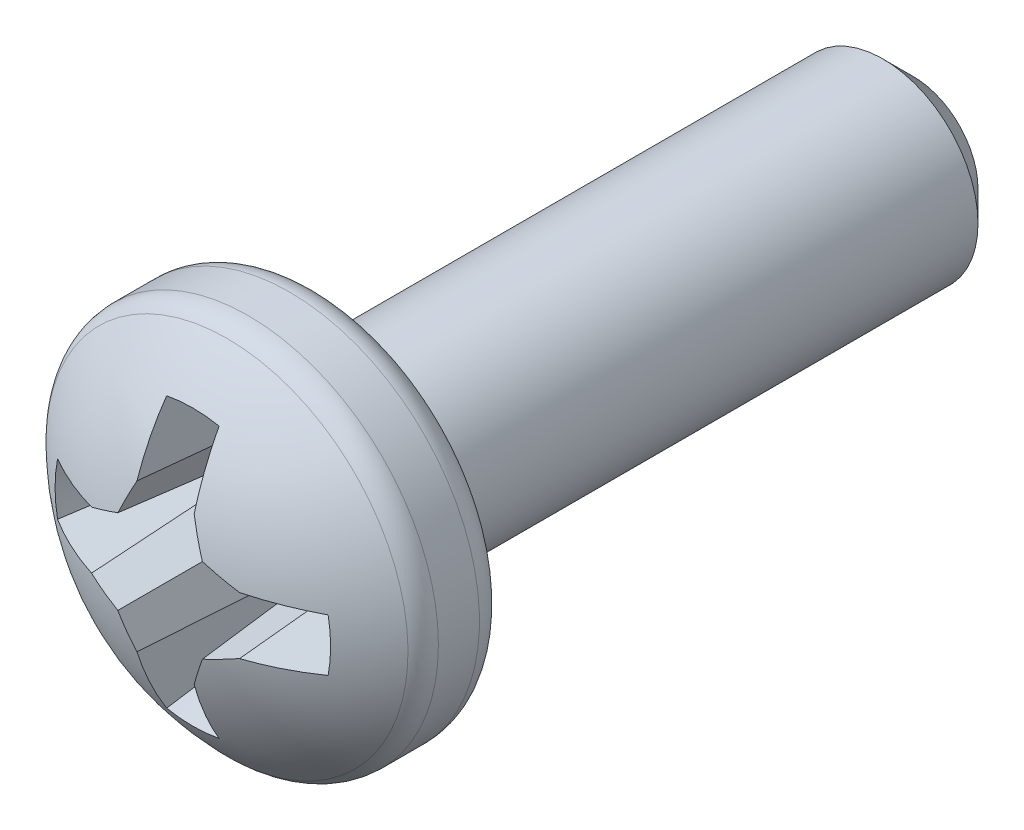
ISO-10303-21;
HEADER;
FILE_DESCRIPTION(('STEP AP214'),'2;1');
FILE_NAME('part.step','',(''),(''),'','','');
FILE_SCHEMA(('AUTOMOTIVE_DESIGN { 1 0 10303 214 1 1 1 1 }'));
ENDSEC;
DATA;
#1=APPLICATION_CONTEXT('core data for automotive mechanical design processes');
#2=APPLICATION_PROTOCOL_DEFINITION('international standard','automotive_design',2000,#1);
#3=PRODUCT_CONTEXT('',#1,'mechanical');
#4=PRODUCT('Part','Part','',(#3));
#5=PRODUCT_RELATED_PRODUCT_CATEGORY('part','',(#4));
#6=PRODUCT_DEFINITION_FORMATION('','',#4);
#7=PRODUCT_DEFINITION_CONTEXT('part definition',#1,'design');
#8=PRODUCT_DEFINITION('design','',#6,#7);
#9=PRODUCT_DEFINITION_SHAPE('','',#8);
#10=(LENGTH_UNIT() NAMED_UNIT(*) SI_UNIT(.MILLI.,.METRE.));
#11=(NAMED_UNIT(*) PLANE_ANGLE_UNIT() SI_UNIT($,.RADIAN.));
#12=(NAMED_UNIT(*) SI_UNIT($,.STERADIAN.) SOLID_ANGLE_UNIT());
#13=UNCERTAINTY_MEASURE_WITH_UNIT(LENGTH_MEASURE(1.E-05),#10,'distance_accuracy_value','');
#14=(GEOMETRIC_REPRESENTATION_CONTEXT(3) GLOBAL_UNCERTAINTY_ASSIGNED_CONTEXT((#13)) GLOBAL_UNIT_ASSIGNED_CONTEXT((#10,
#11,#12)) REPRESENTATION_CONTEXT('',''));
#15=CARTESIAN_POINT('',(0.,0.,0.));
#16=DIRECTION('',(0.,0.,1.));
#17=DIRECTION('',(1.,0.,0.));
#18=AXIS2_PLACEMENT_3D('',#15,#16,#17);
#19=CARTESIAN_POINT('',(1.1012783253842,0.791461441644268,0.413196607862429));
#20=DIRECTION('',(0.,0.,1.));
#21=DIRECTION('',(1.,0.,0.));
#22=AXIS2_PLACEMENT_3D('',#19,#20,#21);
#23=PLANE('',#22);
#24=DIRECTION('',(0.382683432365081,-0.92387953251129,0.));
#25=VECTOR('',#24,1.);
#26=CARTESIAN_POINT('',(1.11459221215408,0.796976234112247,0.413196607862429));
#27=LINE('',#26,#25);
#28=CARTESIAN_POINT('',(1.1070219667387,0.815252423264536,0.413196607862429));
#29=VERTEX_POINT('',#28);
#30=CARTESIAN_POINT('',(1.11230791032016,0.802491026580227,0.413196607862429));
#31=VERTEX_POINT('',#30);
#32=EDGE_CURVE('E292',#29,#31,#27,.T.);
#33=ORIENTED_EDGE('',*,*,#32,.F.);
#34=DIRECTION('',(0.,1.,0.));
#35=VECTOR('',#34,1.);
#36=CARTESIAN_POINT('',(1.10702196673869,0.791461441644268,0.413196607862429));
#37=LINE('',#36,#35);
#38=CARTESIAN_POINT('',(1.10702196673869,0.82766777029474,0.413196607862429));
#39=VERTEX_POINT('',#38);
#40=EDGE_CURVE('E168',#39,#29,#37,.F.);
#41=ORIENTED_EDGE('',*,*,#40,.F.);
#42=CARTESIAN_POINT('',(1.1012783253842,0.791461441644268,0.413196607862429));
#43=DIRECTION('',(0.,0.,1.));
#44=DIRECTION('',(1.,0.,0.));
#45=AXIS2_PLACEMENT_3D('',#42,#43,#44);
#46=CIRCLE('',#45,0.0366590732337168);
#47=CARTESIAN_POINT('',(1.09553468402971,0.827667770294741,0.413196607862429));
#48=VERTEX_POINT('',#47);
#49=EDGE_CURVE('E159',#39,#48,#46,.T.);
#50=ORIENTED_EDGE('',*,*,#49,.T.);
#51=DIRECTION('',(0.,1.,0.));
#52=VECTOR('',#51,1.);
#53=CARTESIAN_POINT('',(1.09553468402971,0.791461441644271,0.413196607862429));
#54=LINE('',#53,#52);
#55=CARTESIAN_POINT('',(1.09553468402971,0.815252423264539,0.413196607862429));
#56=VERTEX_POINT('',#55);
#57=EDGE_CURVE('E166',#56,#48,#54,.T.);
#58=ORIENTED_EDGE('',*,*,#57,.F.);
#59=DIRECTION('',(0.382683432365079,0.923879532511291,0.));
#60=VECTOR('',#59,1.);
#61=CARTESIAN_POINT('',(1.08796443861433,0.79697623411225,0.413196607862429));
#62=LINE('',#61,#60);
#63=CARTESIAN_POINT('',(1.09024874044825,0.80249102658023,0.413196607862429));
#64=VERTEX_POINT('',#63);
#65=EDGE_CURVE('E301',#64,#56,#62,.T.);
#66=ORIENTED_EDGE('',*,*,#65,.F.);
#67=DIRECTION('',(0.923879532511289,0.382683432365086,0.));
#68=VECTOR('',#67,1.);
#69=CARTESIAN_POINT('',(1.09576353291623,0.804775328414139,0.413196607862429));
#70=LINE('',#69,#68);
#71=CARTESIAN_POINT('',(1.07748734376394,0.797205082998765,0.413196607862429));
#72=VERTEX_POINT('',#71);
#73=EDGE_CURVE('E307',#72,#64,#70,.T.);
#74=ORIENTED_EDGE('',*,*,#73,.F.);
#75=DIRECTION('',(1.,0.,0.));
#76=VECTOR('',#75,1.);
#77=CARTESIAN_POINT('',(1.10127832538421,0.797205082998765,0.413196607862429));
#78=LINE('',#77,#76);
#79=CARTESIAN_POINT('',(1.06507199667653,0.797205082997996,0.413196607853643));
#80=VERTEX_POINT('',#79);
#81=EDGE_CURVE('E313',#80,#72,#78,.T.);
#82=ORIENTED_EDGE('',*,*,#81,.F.);
#83=CARTESIAN_POINT('',(1.10127832538421,0.791461441644271,0.413196607862429));
#84=DIRECTION('',(0.,0.,1.));
#85=DIRECTION('',(1.,0.,0.));
#86=AXIS2_PLACEMENT_3D('',#83,#84,#85);
#87=CIRCLE('',#86,0.0366590732924525);
#88=CARTESIAN_POINT('',(1.06507199667427,0.78571780028978,0.413196607862429));
#89=VERTEX_POINT('',#88);
#90=EDGE_CURVE('E410',#80,#89,#87,.T.);
#91=ORIENTED_EDGE('',*,*,#90,.T.);
#92=DIRECTION('',(1.,0.,0.));
#93=VECTOR('',#92,1.);
#94=CARTESIAN_POINT('',(1.1012783253842,0.78571780028978,0.413196607862429));
#95=LINE('',#94,#93);
#96=CARTESIAN_POINT('',(1.07748734376393,0.78571780028978,0.413196607862429));
#97=VERTEX_POINT('',#96);
#98=EDGE_CURVE('E247',#97,#89,#95,.F.);
#99=ORIENTED_EDGE('',*,*,#98,.F.);
#100=DIRECTION('',(-0.923879532511292,0.382683432365076,0.));
#101=VECTOR('',#100,1.);
#102=CARTESIAN_POINT('',(1.09576353291622,0.778147554874406,0.413196607862429));
#103=LINE('',#102,#101);
#104=CARTESIAN_POINT('',(1.09024874044825,0.780431856708313,0.413196607862429));
#105=VERTEX_POINT('',#104);
#106=EDGE_CURVE('E248',#105,#97,#103,.T.);
#107=ORIENTED_EDGE('',*,*,#106,.F.);
#108=DIRECTION('',(-0.38268343236509,0.923879532511287,0.));
#109=VECTOR('',#108,1.);
#110=CARTESIAN_POINT('',(1.08796443861433,0.785946649176296,0.413196607862429));
#111=LINE('',#110,#109);
#112=CARTESIAN_POINT('',(1.09553468402971,0.767670460024005,0.413196607862429));
#113=VERTEX_POINT('',#112);
#114=EDGE_CURVE('E254',#113,#105,#111,.T.);
#115=ORIENTED_EDGE('',*,*,#114,.F.);
#116=DIRECTION('',(0.,1.,0.));
#117=VECTOR('',#116,1.);
#118=CARTESIAN_POINT('',(1.09553468402971,0.791461441644275,0.413196607862429));
#119=LINE('',#118,#117);
#120=CARTESIAN_POINT('',(1.09553468402971,0.755255112951671,0.413196607862429));
#121=VERTEX_POINT('',#120);
#122=EDGE_CURVE('E260',#121,#113,#119,.T.);
#123=ORIENTED_EDGE('',*,*,#122,.F.);
#124=CARTESIAN_POINT('',(1.1012783253842,0.791461441644275,0.413196607862429));
#125=DIRECTION('',(0.,0.,1.));
#126=DIRECTION('',(1.,0.,0.));
#127=AXIS2_PLACEMENT_3D('',#124,#125,#126);
#128=CIRCLE('',#127,0.0366590732753286);
#129=CARTESIAN_POINT('',(1.1070219667387,0.755255112951671,0.413196607862429));
#130=VERTEX_POINT('',#129);
#131=EDGE_CURVE('E336',#121,#130,#128,.T.);
#132=ORIENTED_EDGE('',*,*,#131,.T.);
#133=DIRECTION('',(0.,1.,0.));
#134=VECTOR('',#133,1.);
#135=CARTESIAN_POINT('',(1.1070219667387,0.791461441644272,0.413196607862429));
#136=LINE('',#135,#134);
#137=CARTESIAN_POINT('',(1.10702196673869,0.767670460024002,0.413196607862429));
#138=VERTEX_POINT('',#137);
#139=EDGE_CURVE('E266',#138,#130,#136,.F.);
#140=ORIENTED_EDGE('',*,*,#139,.F.);
#141=DIRECTION('',(-0.382683432365075,-0.923879532511293,0.));
#142=VECTOR('',#141,1.);
#143=CARTESIAN_POINT('',(1.11459221215407,0.785946649176293,0.413196607862429));
#144=LINE('',#143,#142);
#145=CARTESIAN_POINT('',(1.11230791032016,0.780431856708314,0.413196607862429));
#146=VERTEX_POINT('',#145);
#147=EDGE_CURVE('E267',#146,#138,#144,.T.);
#148=ORIENTED_EDGE('',*,*,#147,.F.);
#149=DIRECTION('',(-0.923879532511286,-0.382683432365092,0.));
#150=VECTOR('',#149,1.);
#151=CARTESIAN_POINT('',(1.10679311785218,0.778147554874402,0.413196607862429));
#152=LINE('',#151,#150);
#153=CARTESIAN_POINT('',(1.12506930700447,0.785717800289777,0.413196607862429));
#154=VERTEX_POINT('',#153);
#155=EDGE_CURVE('E273',#154,#146,#152,.T.);
#156=ORIENTED_EDGE('',*,*,#155,.F.);
#157=DIRECTION('',(1.,0.,0.));
#158=VECTOR('',#157,1.);
#159=CARTESIAN_POINT('',(1.1012783253842,0.785717800289777,0.413196607862429));
#160=LINE('',#159,#158);
#161=CARTESIAN_POINT('',(1.13748465403467,0.785717800289777,0.413196607862429));
#162=VERTEX_POINT('',#161);
#163=EDGE_CURVE('E279',#162,#154,#160,.F.);
#164=ORIENTED_EDGE('',*,*,#163,.F.);
#165=CARTESIAN_POINT('',(1.1012783253842,0.791461441644268,0.413196607862429));
#166=DIRECTION('',(0.,0.,1.));
#167=DIRECTION('',(1.,0.,0.));
#168=AXIS2_PLACEMENT_3D('',#165,#166,#167);
#169=CIRCLE('',#168,0.0366590732337168);
#170=CARTESIAN_POINT('',(1.13748465403467,0.797205082998762,0.413196607862429));
#171=VERTEX_POINT('',#170);
#172=EDGE_CURVE('E492',#162,#171,#169,.T.);
#173=ORIENTED_EDGE('',*,*,#172,.T.);
#174=DIRECTION('',(1.,0.,0.));
#175=VECTOR('',#174,1.);
#176=CARTESIAN_POINT('',(1.1012783253842,0.797205082998762,0.413196607862429));
#177=LINE('',#176,#175);
#178=CARTESIAN_POINT('',(1.12506930700447,0.797205082998762,0.413196607862429));
#179=VERTEX_POINT('',#178);
#180=EDGE_CURVE('E285',#179,#171,#177,.T.);
#181=ORIENTED_EDGE('',*,*,#180,.F.);
#182=DIRECTION('',(0.92387953251129,-0.382683432365083,0.));
#183=VECTOR('',#182,1.);
#184=CARTESIAN_POINT('',(1.10679311785218,0.804775328414136,0.413196607862429));
#185=LINE('',#184,#183);
#186=EDGE_CURVE('E286',#31,#179,#185,.T.);
#187=ORIENTED_EDGE('',*,*,#186,.F.);
#188=EDGE_LOOP('',(#33,#41,#50,#58,#66,#74,#82,#91,#99,#107,#115,#123,#132,#140,#148,#156,#164,
#173,#181,#187));
#189=FACE_BOUND('',#188,.T.);
#190=ADVANCED_FACE('F17',(#189),#23,.T.);
#191=CARTESIAN_POINT('',(1.10127832538421,0.801303961329311,0.460047001563216));
#192=DIRECTION('',(0.,-0.996194698091744,0.0871557427476727));
#193=DIRECTION('',(0.,-0.0871557427476727,-0.996194698091744));
#194=AXIS2_PLACEMENT_3D('',#191,#192,#193);
#195=PLANE('',#194);
#196=DIRECTION('',(0.0173337504938674,-0.0871426484044457,-0.996045029063885));
#197=VECTOR('',#196,1.);
#198=CARTESIAN_POINT('',(1.07674394325958,0.8009424097128,0.455914447676356));
#199=LINE('',#198,#197);
#200=CARTESIAN_POINT('',(1.07674394325958,0.8009424097128,0.455914447676357));
#201=VERTEX_POINT('',#200);
#202=EDGE_CURVE('E310',#201,#72,#199,.T.);
#203=ORIENTED_EDGE('',*,*,#202,.F.);
#204=CARTESIAN_POINT('',(1.0564306923124,0.800151088875881,0.4468696091221));
#205=CARTESIAN_POINT('',(1.05961905199557,0.800321424804083,0.448816557690385));
#206=CARTESIAN_POINT('',(1.06290600274941,0.800472536171256,0.450543768520715));
#207=CARTESIAN_POINT('',(1.06967708639845,0.800736309783544,0.453558714705463));
#208=CARTESIAN_POINT('',(1.07316121929364,0.800848972028658,0.454846450059882));
#209=CARTESIAN_POINT('',(1.07674394325952,0.800942409712743,0.455914447676345));
#210=B_SPLINE_CURVE_WITH_KNOTS('',3,(#204,#205,#206,#207,#208,#209),.UNSPECIFIED.,.F.,.F.,(4,2,
4),(0.,0.011148597867128,0.0222971957342561),.UNSPECIFIED.);
#211=CARTESIAN_POINT('',(1.05643069232298,0.800151088874494,0.446869609106246));
#212=VERTEX_POINT('',#211);
#213=EDGE_CURVE('E409',#212,#201,#210,.T.);
#214=ORIENTED_EDGE('',*,*,#213,.F.);
#215=CARTESIAN_POINT('',(1.05643069233356,0.800151088873107,0.446869609090393));
#216=CARTESIAN_POINT('',(1.05786716011132,0.79966000435443,0.441256487356839));
#217=CARTESIAN_POINT('',(1.05930550268687,0.799168961608414,0.435643843086987));
#218=CARTESIAN_POINT('',(1.06218593746853,0.798186959649786,0.424419509338453));
#219=CARTESIAN_POINT('',(1.06362802967472,0.797696000437175,0.418807819859795));
#220=CARTESIAN_POINT('',(1.06507199667879,0.797205082997228,0.413196607844861));
#221=B_SPLINE_CURVE_WITH_KNOTS('',3,(#215,#216,#217,#218,#219,#220),.UNSPECIFIED.,.F.,.F.,(4,2,
4),(0.,0.0174443558891333,0.0348887122017169),.UNSPECIFIED.);
#222=EDGE_CURVE('E318',#212,#80,#221,.T.);
#223=ORIENTED_EDGE('',*,*,#222,.T.);
#224=ORIENTED_EDGE('',*,*,#81,.T.);
#225=EDGE_LOOP('',(#203,#214,#223,#224));
#226=FACE_BOUND('',#225,.T.);
#227=ADVANCED_FACE('F427',(#226),#195,.T.);
#228=CARTESIAN_POINT('',(1.09419496008785,0.808562198209984,0.460047001563216));
#229=DIRECTION('',(0.381227206369649,-0.920363891963225,0.0871557427476661));
#230=DIRECTION('',(0.923879532511289,0.382683432365086,0.));
#231=AXIS2_PLACEMENT_3D('',#228,#229,#230);
#232=PLANE('',#231);
#233=DIRECTION('',(0.0666626913468176,-0.0666626913468491,-0.995546167269401));
#234=VECTOR('',#233,1.);
#235=CARTESIAN_POINT('',(1.08726696169668,0.805472805331793,0.457726739301585));
#236=LINE('',#235,#234);
#237=CARTESIAN_POINT('',(1.08726696169668,0.805472805331793,0.457726739301586));
#238=VERTEX_POINT('',#237);
#239=EDGE_CURVE('E304',#238,#64,#236,.T.);
#240=ORIENTED_EDGE('',*,*,#239,.F.);
#241=CARTESIAN_POINT('',(1.07674394325958,0.8009424097128,0.455914447676357));
#242=CARTESIAN_POINT('',(1.07847431281451,0.801700049456702,0.4563463218226));
#243=CARTESIAN_POINT('',(1.08021641579507,0.802456402296903,0.456713283197824));
#244=CARTESIAN_POINT('',(1.08372408860744,0.803966534169899,0.457317380406234));
#245=CARTESIAN_POINT('',(1.08548965843925,0.804720313202696,0.45755451623942));
#246=CARTESIAN_POINT('',(1.08726696169669,0.80547280533179,0.457726739301587));
#247=B_SPLINE_CURVE_WITH_KNOTS('',3,(#241,#242,#243,#244,#245,#246),.UNSPECIFIED.,.F.,.F.,(4,2,
4),(0.,0.0058030059091772,0.0116060118183545),.UNSPECIFIED.);
#248=EDGE_CURVE('E439',#201,#238,#247,.T.);
#249=ORIENTED_EDGE('',*,*,#248,.F.);
#250=ORIENTED_EDGE('',*,*,#202,.T.);
#251=ORIENTED_EDGE('',*,*,#73,.T.);
#252=EDGE_LOOP('',(#240,#249,#250,#251));
#253=FACE_BOUND('',#252,.T.);
#254=ADVANCED_FACE('F431',(#253),#232,.T.);
#255=CARTESIAN_POINT('',(1.08417756881849,0.79854480694063,0.460047001563216));
#256=DIRECTION('',(0.920363891963229,-0.381227206369643,0.0871557427476506));
#257=DIRECTION('',(0.382683432365079,0.923879532511291,0.));
#258=AXIS2_PLACEMENT_3D('',#255,#256,#257);
#259=PLANE('',#258);
#260=DIRECTION('',(0.0871426484044308,-0.0173337504938857,-0.996045029063886));
#261=VECTOR('',#260,1.);
#262=CARTESIAN_POINT('',(1.09179735731568,0.8159958237689,0.455914447676355));
#263=LINE('',#262,#261);
#264=CARTESIAN_POINT('',(1.09179735731568,0.8159958237689,0.455914447676355));
#265=VERTEX_POINT('',#264);
#266=EDGE_CURVE('E176',#265,#56,#263,.T.);
#267=ORIENTED_EDGE('',*,*,#266,.F.);
#268=CARTESIAN_POINT('',(1.08726696169668,0.805472805331793,0.457726739301586));
#269=CARTESIAN_POINT('',(1.08801945382578,0.807250108589228,0.457554516239418));
#270=CARTESIAN_POINT('',(1.08877323285857,0.809015678421038,0.457317380406232));
#271=CARTESIAN_POINT('',(1.09028336473157,0.812523351233407,0.456713283197822));
#272=CARTESIAN_POINT('',(1.09103971757177,0.814265454213967,0.456346321822597));
#273=CARTESIAN_POINT('',(1.09179735731568,0.815995823768902,0.455914447676354));
#274=B_SPLINE_CURVE_WITH_KNOTS('',3,(#268,#269,#270,#271,#272,#273),.UNSPECIFIED.,.F.,.F.,(4,2,
4),(0.,0.00580300590917744,0.0116060118183552),.UNSPECIFIED.);
#275=EDGE_CURVE('E445',#238,#265,#274,.T.);
#276=ORIENTED_EDGE('',*,*,#275,.F.);
#277=ORIENTED_EDGE('',*,*,#239,.T.);
#278=ORIENTED_EDGE('',*,*,#65,.T.);
#279=EDGE_LOOP('',(#267,#276,#277,#278));
#280=FACE_BOUND('',#279,.T.);
#281=ADVANCED_FACE('F436',(#280),#259,.T.);
#282=CARTESIAN_POINT('',(1.09143580569917,0.791461441644271,0.460047001563216));
#283=DIRECTION('',(0.996194698091747,0.,0.0871557427476441));
#284=DIRECTION('',(0.0871557427476441,0.,-0.996194698091747));
#285=AXIS2_PLACEMENT_3D('',#282,#283,#284);
#286=PLANE('',#285);
#287=CARTESIAN_POINT('',(1.09553468402404,0.827667770303427,0.413196607882759));
#288=CARTESIAN_POINT('',(1.09504376658613,0.829111737312785,0.418807819896611));
#289=CARTESIAN_POINT('',(1.09455280737493,0.830553829524812,0.424419509373993));
#290=CARTESIAN_POINT('',(1.09357080541786,0.833434264319245,0.435643843119583));
#291=CARTESIAN_POINT('',(1.09307976267199,0.834872606901741,0.441256487387769));
#292=CARTESIAN_POINT('',(1.09258867815283,0.836309074686999,0.446869609119461));
#293=B_SPLINE_CURVE_WITH_KNOTS('',3,(#287,#288,#289,#290,#291,#292),.UNSPECIFIED.,.F.,.F.,(4,2,
4),(0.,0.0174443563128722,0.0348887122022951),.UNSPECIFIED.);
#294=CARTESIAN_POINT('',(1.09258867815339,0.836309074685362,0.446869609113066));
#295=VERTEX_POINT('',#294);
#296=EDGE_CURVE('E170',#48,#295,#293,.T.);
#297=ORIENTED_EDGE('',*,*,#296,.T.);
#298=CARTESIAN_POINT('',(1.09179735731568,0.815995823768901,0.455914447676355));
#299=CARTESIAN_POINT('',(1.09189079499972,0.81957854773212,0.454846450060693));
#300=CARTESIAN_POINT('',(1.09200345724476,0.823062680624827,0.453558714707388));
#301=CARTESIAN_POINT('',(1.09226723085682,0.82983376426922,0.450543768525487));
#302=CARTESIAN_POINT('',(1.09241834222383,0.833120715020905,0.448816557696893));
#303=CARTESIAN_POINT('',(1.09258867815185,0.836309074702078,0.446869609130654));
#304=B_SPLINE_CURVE_WITH_KNOTS('',3,(#298,#299,#300,#301,#302,#303),.UNSPECIFIED.,.F.,.F.,(4,2,
4),(0.,0.011148597858965,0.0222971957179303),.UNSPECIFIED.);
#305=EDGE_CURVE('E450',#265,#295,#304,.T.);
#306=ORIENTED_EDGE('',*,*,#305,.F.);
#307=ORIENTED_EDGE('',*,*,#266,.T.);
#308=ORIENTED_EDGE('',*,*,#57,.T.);
#309=EDGE_LOOP('',(#297,#306,#307,#308));
#310=FACE_BOUND('',#309,.T.);
#311=ADVANCED_FACE('F173',(#310),#286,.T.);
#312=CARTESIAN_POINT('',(1.1012783253842,0.791461441644268,0.446869608992984));
#313=DIRECTION('',(0.,0.,1.));
#314=DIRECTION('',(1.,0.,0.));
#315=AXIS2_PLACEMENT_3D('',#312,#313,#314);
#316=CONICAL_SURFACE('',#315,0.0456817267126014,0.261799388331704);
#317=ORIENTED_EDGE('',*,*,#296,.F.);
#318=ORIENTED_EDGE('',*,*,#49,.F.);
#319=CARTESIAN_POINT('',(1.10996797262069,0.836309074692748,0.446869609127048));
#320=CARTESIAN_POINT('',(1.10947688809974,0.834872606905537,0.441256487392909));
#321=CARTESIAN_POINT('',(1.10898584535217,0.833434264321139,0.435643843122255));
#322=CARTESIAN_POINT('',(1.10800384339188,0.830553829523008,0.424419509371686));
#323=CARTESIAN_POINT('',(1.10751288417916,0.829111737309184,0.418807819891794));
#324=CARTESIAN_POINT('',(1.10702196673983,0.827667770298081,0.413196607875411));
#325=B_SPLINE_CURVE_WITH_KNOTS('',3,(#319,#320,#321,#322,#323,#324),.UNSPECIFIED.,.F.,.F.,(4,2,
4),(0.,0.017444355898411,0.0348887122202734),.UNSPECIFIED.);
#326=CARTESIAN_POINT('',(1.10996797261646,0.836309074695643,0.446869609129504));
#327=VERTEX_POINT('',#326);
#328=EDGE_CURVE('E182',#327,#39,#325,.T.);
#329=ORIENTED_EDGE('',*,*,#328,.F.);
#330=CARTESIAN_POINT('',(1.1012783253842,0.791461441644268,0.44686960910667));
#331=DIRECTION('',(0.,0.,1.));
#332=DIRECTION('',(1.,0.,0.));
#333=AXIS2_PLACEMENT_3D('',#330,#331,#332);
#334=CIRCLE('',#333,0.0456817267430637);
#335=EDGE_CURVE('E180',#295,#327,#334,.F.);
#336=ORIENTED_EDGE('',*,*,#335,.F.);
#337=EDGE_LOOP('',(#317,#318,#329,#336));
#338=FACE_BOUND('',#337,.T.);
#339=ADVANCED_FACE('F178',(#338),#316,.F.);
#340=CARTESIAN_POINT('',(1.11112084506924,0.791461441644268,0.460047001563216));
#341=DIRECTION('',(-0.996194698091746,0.,0.0871557427476584));
#342=DIRECTION('',(0.0871557427476584,0.,0.996194698091746));
#343=AXIS2_PLACEMENT_3D('',#340,#341,#342);
#344=PLANE('',#343);
#345=DIRECTION('',(-0.0871426484044237,-0.0173337504939004,-0.996045029063886));
#346=VECTOR('',#345,1.);
#347=CARTESIAN_POINT('',(1.11075929345274,0.815995823768898,0.455914447676356));
#348=LINE('',#347,#346);
#349=CARTESIAN_POINT('',(1.11075929345274,0.815995823768898,0.455914447676355));
#350=VERTEX_POINT('',#349);
#351=EDGE_CURVE('E295',#350,#29,#348,.T.);
#352=ORIENTED_EDGE('',*,*,#351,.F.);
#353=CARTESIAN_POINT('',(1.10996797261656,0.836309074702021,0.446869609130688));
#354=CARTESIAN_POINT('',(1.11013830854457,0.833120715020857,0.448816557696918));
#355=CARTESIAN_POINT('',(1.11028941991159,0.829833764269183,0.450543768525504));
#356=CARTESIAN_POINT('',(1.11055319352365,0.823062680624813,0.453558714707391));
#357=CARTESIAN_POINT('',(1.11066585576869,0.819578547732117,0.454846450060692));
#358=CARTESIAN_POINT('',(1.11075929345273,0.815995823768911,0.45591444767635));
#359=B_SPLINE_CURVE_WITH_KNOTS('',3,(#353,#354,#355,#356,#357,#358),.UNSPECIFIED.,.F.,.F.,(4,2,
4),(0.,0.0111485978589261,0.0222971957178522),.UNSPECIFIED.);
#360=EDGE_CURVE('E210',#327,#350,#359,.T.);
#361=ORIENTED_EDGE('',*,*,#360,.F.);
#362=ORIENTED_EDGE('',*,*,#328,.T.);
#363=ORIENTED_EDGE('',*,*,#40,.T.);
#364=EDGE_LOOP('',(#352,#361,#362,#363));
#365=FACE_BOUND('',#364,.T.);
#366=ADVANCED_FACE('F199',(#365),#344,.T.);
#367=CARTESIAN_POINT('',(1.11837908194992,0.798544806940627,0.460047001563216));
#368=DIRECTION('',(-0.920363891963228,-0.381227206369645,0.0871557427476584));
#369=DIRECTION('',(0.382683432365081,-0.92387953251129,0.));
#370=AXIS2_PLACEMENT_3D('',#367,#368,#369);
#371=PLANE('',#370);
#372=DIRECTION('',(-0.0666626913467981,-0.066662691346849,-0.995546167269402));
#373=VECTOR('',#372,1.);
#374=CARTESIAN_POINT('',(1.11528968907172,0.805472805331788,0.457726739301586));
#375=LINE('',#374,#373);
#376=CARTESIAN_POINT('',(1.11528968907172,0.805472805331788,0.457726739301586));
#377=VERTEX_POINT('',#376);
#378=EDGE_CURVE('E289',#377,#31,#375,.T.);
#379=ORIENTED_EDGE('',*,*,#378,.F.);
#380=CARTESIAN_POINT('',(1.11075929345274,0.815995823768898,0.455914447676354));
#381=CARTESIAN_POINT('',(1.11151693319664,0.814265454213963,0.456346321822597));
#382=CARTESIAN_POINT('',(1.11227328603684,0.812523351233404,0.456713283197821));
#383=CARTESIAN_POINT('',(1.11378341790984,0.809015678421035,0.457317380406231));
#384=CARTESIAN_POINT('',(1.11453719694263,0.807250108589225,0.457554516239417));
#385=CARTESIAN_POINT('',(1.11528968907173,0.80547280533179,0.457726739301585));
#386=B_SPLINE_CURVE_WITH_KNOTS('',3,(#380,#381,#382,#383,#384,#385),.UNSPECIFIED.,.F.,.F.,(4,2,
4),(0.,0.00580300590917688,0.0116060118183538),.UNSPECIFIED.);
#387=EDGE_CURVE('E218',#350,#377,#386,.T.);
#388=ORIENTED_EDGE('',*,*,#387,.F.);
#389=ORIENTED_EDGE('',*,*,#351,.T.);
#390=ORIENTED_EDGE('',*,*,#32,.T.);
#391=EDGE_LOOP('',(#379,#388,#389,#390));
#392=FACE_BOUND('',#391,.T.);
#393=ADVANCED_FACE('F204',(#392),#371,.T.);
#394=CARTESIAN_POINT('',(1.10836169068056,0.808562198209981,0.460047001563216));
#395=DIRECTION('',(-0.381227206369647,-0.920363891963227,0.0871557427476583));
#396=DIRECTION('',(0.92387953251129,-0.382683432365083,0.));
#397=AXIS2_PLACEMENT_3D('',#394,#395,#396);
#398=PLANE('',#397);
#399=DIRECTION('',(-0.0173337504938623,-0.0871426484044405,-0.996045029063885));
#400=VECTOR('',#399,1.);
#401=CARTESIAN_POINT('',(1.12581270750883,0.800942409712797,0.455914447676356));
#402=LINE('',#401,#400);
#403=CARTESIAN_POINT('',(1.12581270750883,0.800942409712797,0.455914447676355));
#404=VERTEX_POINT('',#403);
#405=EDGE_CURVE('E282',#404,#179,#402,.T.);
#406=ORIENTED_EDGE('',*,*,#405,.F.);
#407=CARTESIAN_POINT('',(1.11528968907172,0.805472805331788,0.457726739301586));
#408=CARTESIAN_POINT('',(1.11706699232916,0.804720313202693,0.457554516239419));
#409=CARTESIAN_POINT('',(1.11883256216097,0.803966534169897,0.457317380406232));
#410=CARTESIAN_POINT('',(1.12234023497334,0.8024564022969,0.456713283197822));
#411=CARTESIAN_POINT('',(1.1240823379539,0.801700049456699,0.456346321822598));
#412=CARTESIAN_POINT('',(1.12581270750883,0.800942409712797,0.455914447676355));
#413=B_SPLINE_CURVE_WITH_KNOTS('',3,(#407,#408,#409,#410,#411,#412),.UNSPECIFIED.,.F.,.F.,(4,2,
4),(0.,0.00580300590917796,0.0116060118183557),.UNSPECIFIED.);
#414=EDGE_CURVE('E462',#377,#404,#413,.T.);
#415=ORIENTED_EDGE('',*,*,#414,.F.);
#416=ORIENTED_EDGE('',*,*,#378,.T.);
#417=ORIENTED_EDGE('',*,*,#186,.T.);
#418=EDGE_LOOP('',(#406,#415,#416,#417));
#419=FACE_BOUND('',#418,.T.);
#420=ADVANCED_FACE('F474',(#419),#398,.T.);
#421=CARTESIAN_POINT('',(1.1012783253842,0.801303961329307,0.460047001563216));
#422=DIRECTION('',(0.,-0.996194698091746,0.0871557427476584));
#423=DIRECTION('',(0.,-0.0871557427476584,-0.996194698091746));
#424=AXIS2_PLACEMENT_3D('',#421,#422,#423);
#425=PLANE('',#424);
#426=CARTESIAN_POINT('',(1.13748465403987,0.797205083000528,0.413196607882621));
#427=CARTESIAN_POINT('',(1.13892862105086,0.79769600044035,0.418807819896115));
#428=CARTESIAN_POINT('',(1.140370713264,0.798186959652833,0.424419509373329));
#429=CARTESIAN_POINT('',(1.14325114805959,0.799168961611208,0.435643843118965));
#430=CARTESIAN_POINT('',(1.14468949064214,0.799660004357097,0.441256487387364));
#431=CARTESIAN_POINT('',(1.14612595842693,0.800151088875646,0.44686960911946));
#432=B_SPLINE_CURVE_WITH_KNOTS('',3,(#426,#427,#428,#429,#430,#431),.UNSPECIFIED.,.F.,.F.,(4,2,
4),(0.,0.0174443563135363,0.0348887122036222),.UNSPECIFIED.);
#433=CARTESIAN_POINT('',(1.14612595842529,0.800151088875087,0.446869609113065));
#434=VERTEX_POINT('',#433);
#435=EDGE_CURVE('E351',#171,#434,#432,.T.);
#436=ORIENTED_EDGE('',*,*,#435,.T.);
#437=CARTESIAN_POINT('',(1.12581270750883,0.800942409712797,0.455914447676355));
#438=CARTESIAN_POINT('',(1.12939543147206,0.800848972028772,0.454846450060687));
#439=CARTESIAN_POINT('',(1.13287956436478,0.800736309783735,0.453558714707376));
#440=CARTESIAN_POINT('',(1.1396506480092,0.80047253617164,0.450543768525466));
#441=CARTESIAN_POINT('',(1.14293759876089,0.800321424804581,0.448816557696868));
#442=CARTESIAN_POINT('',(1.14612595844208,0.800151088876511,0.446869609130625));
#443=B_SPLINE_CURVE_WITH_KNOTS('',3,(#437,#438,#439,#440,#441,#442),.UNSPECIFIED.,.F.,.F.,(4,2,
4),(0.,0.0111485978590051,0.0222971957180103),.UNSPECIFIED.);
#444=EDGE_CURVE('E463',#404,#434,#443,.T.);
#445=ORIENTED_EDGE('',*,*,#444,.F.);
#446=ORIENTED_EDGE('',*,*,#405,.T.);
#447=ORIENTED_EDGE('',*,*,#180,.T.);
#448=EDGE_LOOP('',(#436,#445,#446,#447));
#449=FACE_BOUND('',#448,.T.);
#450=ADVANCED_FACE('F477',(#449),#425,.T.);
#451=CARTESIAN_POINT('',(1.1012783253842,0.791461441644268,0.446869608992984));
#452=DIRECTION('',(0.,0.,1.));
#453=DIRECTION('',(1.,0.,0.));
#454=AXIS2_PLACEMENT_3D('',#451,#452,#453);
#455=CONICAL_SURFACE('',#454,0.0456817267126014,0.261799388331704);
#456=ORIENTED_EDGE('',*,*,#172,.F.);
#457=CARTESIAN_POINT('',(1.14612595843268,0.782771794407784,0.446869609127048));
#458=CARTESIAN_POINT('',(1.14468949064542,0.783262878928753,0.441256487392695));
#459=CARTESIAN_POINT('',(1.14325114806096,0.78375392167634,0.435643843121828));
#460=CARTESIAN_POINT('',(1.14037071326272,0.784735923636665,0.424419509370833));
#461=CARTESIAN_POINT('',(1.13892862104884,0.785226882849402,0.418807819890728));
#462=CARTESIAN_POINT('',(1.13748465403768,0.785717800288753,0.413196607874131));
#463=B_SPLINE_CURVE_WITH_KNOTS('',3,(#457,#458,#459,#460,#461,#462),.UNSPECIFIED.,.F.,.F.,(4,2,
4),(0.,0.0174443558990736,0.0348887122215986),.UNSPECIFIED.);
#464=CARTESIAN_POINT('',(1.14612595843558,0.782771794412015,0.446869609129503));
#465=VERTEX_POINT('',#464);
#466=EDGE_CURVE('E346',#465,#162,#463,.T.);
#467=ORIENTED_EDGE('',*,*,#466,.F.);
#468=CARTESIAN_POINT('',(1.1012783253842,0.791461441644268,0.44686960910667));
#469=DIRECTION('',(0.,0.,1.));
#470=DIRECTION('',(1.,0.,0.));
#471=AXIS2_PLACEMENT_3D('',#468,#469,#470);
#472=CIRCLE('',#471,0.0456817267430637);
#473=EDGE_CURVE('E464',#434,#465,#472,.F.);
#474=ORIENTED_EDGE('',*,*,#473,.F.);
#475=ORIENTED_EDGE('',*,*,#435,.F.);
#476=EDGE_LOOP('',(#456,#467,#474,#475));
#477=FACE_BOUND('',#476,.T.);
#478=ADVANCED_FACE('F482',(#477),#455,.F.);
#479=CARTESIAN_POINT('',(1.1012783253842,0.781618921959232,0.460047001563216));
#480=DIRECTION('',(0.,0.996194698091747,0.0871557427476441));
#481=DIRECTION('',(0.,-0.0871557427476441,0.996194698091747));
#482=AXIS2_PLACEMENT_3D('',#479,#480,#481);
#483=PLANE('',#482);
#484=DIRECTION('',(-0.0173337504938619,0.0871426484044209,-0.996045029063887));
#485=VECTOR('',#484,1.);
#486=CARTESIAN_POINT('',(1.12581270750883,0.781980473575742,0.455914447676357));
#487=LINE('',#486,#485);
#488=CARTESIAN_POINT('',(1.12581270750883,0.781980473575743,0.455914447676356));
#489=VERTEX_POINT('',#488);
#490=EDGE_CURVE('E276',#489,#154,#487,.T.);
#491=ORIENTED_EDGE('',*,*,#490,.F.);
#492=CARTESIAN_POINT('',(1.14612595844196,0.782771794411911,0.446869609130687));
#493=CARTESIAN_POINT('',(1.1429375987608,0.782601458483889,0.448816557696911));
#494=CARTESIAN_POINT('',(1.13965064800913,0.782450347116869,0.450543768525494));
#495=CARTESIAN_POINT('',(1.13287956436478,0.782186573504832,0.45355871470738));
#496=CARTESIAN_POINT('',(1.12939543147209,0.782073911259815,0.454846450060681));
#497=CARTESIAN_POINT('',(1.12581270750889,0.7819804735758,0.455914447676343));
#498=B_SPLINE_CURVE_WITH_KNOTS('',3,(#492,#493,#494,#495,#496,#497),.UNSPECIFIED.,.F.,.F.,(4,2,
4),(0.,0.011148597858902,0.022297195717804),.UNSPECIFIED.);
#499=EDGE_CURVE('E509',#465,#489,#498,.T.);
#500=ORIENTED_EDGE('',*,*,#499,.F.);
#501=ORIENTED_EDGE('',*,*,#466,.T.);
#502=ORIENTED_EDGE('',*,*,#163,.T.);
#503=EDGE_LOOP('',(#491,#500,#501,#502));
#504=FACE_BOUND('',#503,.T.);
#505=ADVANCED_FACE('F499',(#504),#483,.T.);
#506=CARTESIAN_POINT('',(1.10836169068056,0.774360685078558,0.460047001563216));
#507=DIRECTION('',(-0.381227206369656,0.920363891963225,0.0871557427476397));
#508=DIRECTION('',(-0.923879532511286,-0.382683432365092,0.));
#509=AXIS2_PLACEMENT_3D('',#506,#507,#508);
#510=PLANE('',#509);
#511=DIRECTION('',(-0.0666626913468195,0.0666626913468243,-0.995546167269402));
#512=VECTOR('',#511,1.);
#513=CARTESIAN_POINT('',(1.11528968907172,0.777450077956753,0.457726739301588));
#514=LINE('',#513,#512);
#515=CARTESIAN_POINT('',(1.11528968907172,0.777450077956753,0.457726739301588));
#516=VERTEX_POINT('',#515);
#517=EDGE_CURVE('E270',#516,#146,#514,.T.);
#518=ORIENTED_EDGE('',*,*,#517,.F.);
#519=CARTESIAN_POINT('',(1.12581270750883,0.781980473575743,0.455914447676355));
#520=CARTESIAN_POINT('',(1.12408233795389,0.78122283383184,0.456346321822598));
#521=CARTESIAN_POINT('',(1.12234023497333,0.780466480991639,0.456713283197823));
#522=CARTESIAN_POINT('',(1.11883256216096,0.778956349118642,0.457317380406233));
#523=CARTESIAN_POINT('',(1.11706699232915,0.778202570085845,0.457554516239419));
#524=CARTESIAN_POINT('',(1.11528968907172,0.777450077956751,0.457726739301586));
#525=B_SPLINE_CURVE_WITH_KNOTS('',3,(#519,#520,#521,#522,#523,#524),.UNSPECIFIED.,.F.,.F.,(4,2,
4),(0.,0.00580300590917861,0.011606011818357),.UNSPECIFIED.);
#526=EDGE_CURVE('E515',#489,#516,#525,.T.);
#527=ORIENTED_EDGE('',*,*,#526,.F.);
#528=ORIENTED_EDGE('',*,*,#490,.T.);
#529=ORIENTED_EDGE('',*,*,#155,.T.);
#530=EDGE_LOOP('',(#518,#527,#528,#529));
#531=FACE_BOUND('',#530,.T.);
#532=ADVANCED_FACE('F503',(#531),#510,.T.);
#533=CARTESIAN_POINT('',(1.11837908194991,0.784378076347913,0.460047001563216));
#534=DIRECTION('',(-0.920363891963232,0.381227206369639,0.0871557427476397));
#535=DIRECTION('',(-0.382683432365075,-0.923879532511293,0.));
#536=AXIS2_PLACEMENT_3D('',#533,#534,#535);
#537=PLANE('',#536);
#538=DIRECTION('',(-0.087142648404425,0.0173337504938365,-0.996045029063887));
#539=VECTOR('',#538,1.);
#540=CARTESIAN_POINT('',(1.11075929345273,0.766927059519643,0.455914447676357));
#541=LINE('',#540,#539);
#542=CARTESIAN_POINT('',(1.11075929345273,0.766927059519643,0.455914447676357));
#543=VERTEX_POINT('',#542);
#544=EDGE_CURVE('E263',#543,#138,#541,.T.);
#545=ORIENTED_EDGE('',*,*,#544,.F.);
#546=CARTESIAN_POINT('',(1.11528968907172,0.777450077956753,0.457726739301587));
#547=CARTESIAN_POINT('',(1.11453719694262,0.775672774699318,0.45755451623942));
#548=CARTESIAN_POINT('',(1.11378341790983,0.773907204867509,0.457317380406234));
#549=CARTESIAN_POINT('',(1.11227328603683,0.770399532055139,0.456713283197824));
#550=CARTESIAN_POINT('',(1.11151693319663,0.768657429074579,0.4563463218226));
#551=CARTESIAN_POINT('',(1.11075929345273,0.766927059519644,0.455914447676357));
#552=B_SPLINE_CURVE_WITH_KNOTS('',3,(#546,#547,#548,#549,#550,#551),.UNSPECIFIED.,.F.,.F.,(4,2,
4),(0.,0.00580300590917754,0.0116060118183551),.UNSPECIFIED.);
#553=EDGE_CURVE('E535',#516,#543,#552,.T.);
#554=ORIENTED_EDGE('',*,*,#553,.F.);
#555=ORIENTED_EDGE('',*,*,#517,.T.);
#556=ORIENTED_EDGE('',*,*,#147,.T.);
#557=EDGE_LOOP('',(#545,#554,#555,#556));
#558=FACE_BOUND('',#557,.T.);
#559=ADVANCED_FACE('F548',(#558),#537,.T.);
#560=CARTESIAN_POINT('',(1.11112084506924,0.791461441644272,0.460047001563216));
#561=DIRECTION('',(-0.996194698091747,0.,0.0871557427476441));
#562=DIRECTION('',(0.0871557427476441,0.,0.996194698091747));
#563=AXIS2_PLACEMENT_3D('',#560,#561,#562);
#564=PLANE('',#563);
#565=CARTESIAN_POINT('',(1.10702196673733,0.755255112955676,0.413196607846872));
#566=CARTESIAN_POINT('',(1.10751288417802,0.753811145942415,0.418807819870298));
#567=CARTESIAN_POINT('',(1.10800384339138,0.752369053727022,0.424419509357447));
#568=CARTESIAN_POINT('',(1.10898584535149,0.74948861892693,0.435643843122959));
#569=CARTESIAN_POINT('',(1.10947688809825,0.74805027634214,0.441256487401298));
#570=CARTESIAN_POINT('',(1.10996797261767,0.746613808555127,0.446869609143336));
#571=B_SPLINE_CURVE_WITH_KNOTS('',3,(#565,#566,#567,#568,#569,#570),.UNSPECIFIED.,.F.,.F.,(4,2,
4),(0.,0.0174443563442011,0.0348887122649518),.UNSPECIFIED.);
#572=CARTESIAN_POINT('',(1.10996797261855,0.746613808552544,0.446869609153428));
#573=VERTEX_POINT('',#572);
#574=EDGE_CURVE('E559',#130,#573,#571,.T.);
#575=ORIENTED_EDGE('',*,*,#574,.T.);
#576=CARTESIAN_POINT('',(1.11075929345273,0.766927059519644,0.455914447676356));
#577=CARTESIAN_POINT('',(1.11066585576865,0.763344335555103,0.454846450060299));
#578=CARTESIAN_POINT('',(1.11055319352357,0.759860202661157,0.453558714706442));
#579=CARTESIAN_POINT('',(1.11028941991139,0.753089119014451,0.450543768523128));
#580=CARTESIAN_POINT('',(1.11013830854429,0.749802168261692,0.448816557693671));
#581=CARTESIAN_POINT('',(1.10996797261619,0.746613808579527,0.446869609126415));
#582=B_SPLINE_CURVE_WITH_KNOTS('',3,(#576,#577,#578,#579,#580,#581),.UNSPECIFIED.,.F.,.F.,(4,2,
4),(0.,0.0111485978630271,0.0222971957260542),.UNSPECIFIED.);
#583=EDGE_CURVE('E536',#543,#573,#582,.T.);
#584=ORIENTED_EDGE('',*,*,#583,.F.);
#585=ORIENTED_EDGE('',*,*,#544,.T.);
#586=ORIENTED_EDGE('',*,*,#139,.T.);
#587=EDGE_LOOP('',(#575,#584,#585,#586));
#588=FACE_BOUND('',#587,.T.);
#589=ADVANCED_FACE('F551',(#588),#564,.T.);
#590=CARTESIAN_POINT('',(1.1012783253842,0.791461441644275,0.446869609163513));
#591=DIRECTION('',(0.,0.,1.));
#592=DIRECTION('',(1.,0.,0.));
#593=AXIS2_PLACEMENT_3D('',#590,#591,#592);
#594=CONICAL_SURFACE('',#593,0.0456817267978664,0.261799388275177);
#595=ORIENTED_EDGE('',*,*,#131,.F.);
#596=CARTESIAN_POINT('',(1.09258867815897,0.746613808564256,0.446869609131882));
#597=CARTESIAN_POINT('',(1.09307976267453,0.74805027634747,0.441256487392593));
#598=CARTESIAN_POINT('',(1.09357080541861,0.749488618929402,0.435643843117348));
#599=CARTESIAN_POINT('',(1.09455280737571,0.752369053725664,0.424419509358715));
#600=CARTESIAN_POINT('',(1.09504376658873,0.753811145940084,0.418807819875349));
#601=CARTESIAN_POINT('',(1.09553468403026,0.755255112953313,0.41319660785605));
#602=B_SPLINE_CURVE_WITH_KNOTS('',3,(#596,#597,#598,#599,#600,#601),.UNSPECIFIED.,.F.,.F.,(4,2,
4),(0.,0.017444355908991,0.0348887122414304),.UNSPECIFIED.);
#603=CARTESIAN_POINT('',(1.09258867815207,0.746613808568895,0.446869609128016));
#604=VERTEX_POINT('',#603);
#605=EDGE_CURVE('E331',#604,#121,#602,.T.);
#606=ORIENTED_EDGE('',*,*,#605,.F.);
#607=CARTESIAN_POINT('',(1.1012783253842,0.791461441644275,0.446869609163513));
#608=DIRECTION('',(0.,0.,1.));
#609=DIRECTION('',(1.,0.,0.));
#610=AXIS2_PLACEMENT_3D('',#607,#608,#609);
#611=CIRCLE('',#610,0.0456817267978664);
#612=EDGE_CURVE('E538',#573,#604,#611,.F.);
#613=ORIENTED_EDGE('',*,*,#612,.F.);
#614=ORIENTED_EDGE('',*,*,#574,.F.);
#615=EDGE_LOOP('',(#595,#606,#613,#614));
#616=FACE_BOUND('',#615,.T.);
#617=ADVANCED_FACE('F555',(#616),#594,.F.);
#618=CARTESIAN_POINT('',(1.09143580569916,0.791461441644275,0.460047001563216));
#619=DIRECTION('',(0.996194698091746,0.,0.0871557427476584));
#620=DIRECTION('',(0.0871557427476584,0.,-0.996194698091746));
#621=AXIS2_PLACEMENT_3D('',#618,#619,#620);
#622=PLANE('',#621);
#623=DIRECTION('',(0.0871426484044534,0.0173337504937982,-0.996045029063885));
#624=VECTOR('',#623,1.);
#625=CARTESIAN_POINT('',(1.09179735731567,0.766927059519647,0.455914447676358));
#626=LINE('',#625,#624);
#627=CARTESIAN_POINT('',(1.09179735731567,0.766927059519647,0.455914447676358));
#628=VERTEX_POINT('',#627);
#629=EDGE_CURVE('E257',#628,#113,#626,.T.);
#630=ORIENTED_EDGE('',*,*,#629,.F.);
#631=CARTESIAN_POINT('',(1.09258867815223,0.746613808579202,0.446869609126217));
#632=CARTESIAN_POINT('',(1.09241834222412,0.749802168261412,0.44881655769352));
#633=CARTESIAN_POINT('',(1.09226723085702,0.75308911901422,0.450543768523016));
#634=CARTESIAN_POINT('',(1.09200345724484,0.75986020266103,0.453558714706394));
#635=CARTESIAN_POINT('',(1.09189079499975,0.763344335555032,0.454846450060277));
#636=CARTESIAN_POINT('',(1.09179735731567,0.766927059519632,0.455914447676352));
#637=B_SPLINE_CURVE_WITH_KNOTS('',3,(#631,#632,#633,#634,#635,#636),.UNSPECIFIED.,.F.,.F.,(4,2,
4),(0.,0.011148597863211,0.0222971957264219),.UNSPECIFIED.);
#638=EDGE_CURVE('E574',#604,#628,#637,.T.);
#639=ORIENTED_EDGE('',*,*,#638,.F.);
#640=ORIENTED_EDGE('',*,*,#605,.T.);
#641=ORIENTED_EDGE('',*,*,#122,.T.);
#642=EDGE_LOOP('',(#630,#639,#640,#641));
#643=FACE_BOUND('',#642,.T.);
#644=ADVANCED_FACE('F582',(#643),#622,.T.);
#645=CARTESIAN_POINT('',(1.08417756881849,0.784378076347916,0.460047001563216));
#646=DIRECTION('',(0.920363891963225,0.381227206369654,0.0871557427476474));
#647=DIRECTION('',(-0.38268343236509,0.923879532511287,0.));
#648=AXIS2_PLACEMENT_3D('',#645,#646,#647);
#649=PLANE('',#648);
#650=DIRECTION('',(0.0666626913469931,0.0666626913467361,-0.995546167269397));
#651=VECTOR('',#650,1.);
#652=CARTESIAN_POINT('',(1.08726696169668,0.777450077956755,0.457726739301588));
#653=LINE('',#652,#651);
#654=CARTESIAN_POINT('',(1.08726696169668,0.777450077956755,0.457726739301588));
#655=VERTEX_POINT('',#654);
#656=EDGE_CURVE('E251',#655,#105,#653,.T.);
#657=ORIENTED_EDGE('',*,*,#656,.F.);
#658=CARTESIAN_POINT('',(1.09179735731567,0.766927059519647,0.455914447676358));
#659=CARTESIAN_POINT('',(1.09103971757177,0.768657429074582,0.456346321822601));
#660=CARTESIAN_POINT('',(1.09028336473157,0.770399532055142,0.456713283197825));
#661=CARTESIAN_POINT('',(1.08877323285857,0.773907204867512,0.457317380406235));
#662=CARTESIAN_POINT('',(1.08801945382578,0.775672774699321,0.457554516239421));
#663=CARTESIAN_POINT('',(1.08726696169668,0.777450077956756,0.457726739301588));
#664=B_SPLINE_CURVE_WITH_KNOTS('',3,(#658,#659,#660,#661,#662,#663),.UNSPECIFIED.,.F.,.F.,(4,2,
4),(0.,0.00580300590917749,0.0116060118183551),.UNSPECIFIED.);
#665=EDGE_CURVE('E575',#628,#655,#664,.T.);
#666=ORIENTED_EDGE('',*,*,#665,.F.);
#667=ORIENTED_EDGE('',*,*,#629,.T.);
#668=ORIENTED_EDGE('',*,*,#114,.T.);
#669=EDGE_LOOP('',(#657,#666,#667,#668));
#670=FACE_BOUND('',#669,.T.);
#671=ADVANCED_FACE('F585',(#670),#649,.T.);
#672=CARTESIAN_POINT('',(1.09419496008784,0.774360685078562,0.460047001563217));
#673=DIRECTION('',(0.381227206369641,0.920363891963232,0.0871557427476319));
#674=DIRECTION('',(-0.923879532511292,0.382683432365076,0.));
#675=AXIS2_PLACEMENT_3D('',#672,#673,#674);
#676=PLANE('',#675);
#677=DIRECTION('',(0.017333750493862,0.0871426484044134,-0.996045029063888));
#678=VECTOR('',#677,1.);
#679=CARTESIAN_POINT('',(1.07674394325957,0.781980473575746,0.455914447676357));
#680=LINE('',#679,#678);
#681=CARTESIAN_POINT('',(1.07674394325957,0.781980473575746,0.455914447676356));
#682=VERTEX_POINT('',#681);
#683=EDGE_CURVE('E244',#682,#97,#680,.T.);
#684=ORIENTED_EDGE('',*,*,#683,.F.);
#685=CARTESIAN_POINT('',(1.08726696169668,0.777450077956755,0.457726739301587));
#686=CARTESIAN_POINT('',(1.08548965843925,0.778202570085849,0.45755451623942));
#687=CARTESIAN_POINT('',(1.08372408860744,0.778956349118646,0.457317380406234));
#688=CARTESIAN_POINT('',(1.08021641579507,0.780466480991643,0.456713283197823));
#689=CARTESIAN_POINT('',(1.07847431281451,0.781222833831843,0.456346321822599));
#690=CARTESIAN_POINT('',(1.07674394325957,0.781980473575746,0.455914447676356));
#691=B_SPLINE_CURVE_WITH_KNOTS('',3,(#685,#686,#687,#688,#689,#690),.UNSPECIFIED.,.F.,.F.,(4,2,
4),(0.,0.00580300590917813,0.0116060118183565),.UNSPECIFIED.);
#692=EDGE_CURVE('E388',#655,#682,#691,.T.);
#693=ORIENTED_EDGE('',*,*,#692,.F.);
#694=ORIENTED_EDGE('',*,*,#656,.T.);
#695=ORIENTED_EDGE('',*,*,#106,.T.);
#696=EDGE_LOOP('',(#684,#693,#694,#695));
#697=FACE_BOUND('',#696,.T.);
#698=ADVANCED_FACE('F397',(#697),#676,.T.);
#699=CARTESIAN_POINT('',(1.1012783253842,0.781618921959236,0.460047001563216));
#700=DIRECTION('',(0.,0.996194698091748,0.0871557427476297));
#701=DIRECTION('',(0.,-0.0871557427476297,0.996194698091748));
#702=AXIS2_PLACEMENT_3D('',#699,#700,#701);
#703=PLANE('',#702);
#704=CARTESIAN_POINT('',(1.0650719966816,0.785717800294764,0.413196607846229));
#705=CARTESIAN_POINT('',(1.06362802967609,0.785226882853084,0.418807819860587));
#706=CARTESIAN_POINT('',(1.06218593746895,0.78473592363932,0.424419509338843));
#707=CARTESIAN_POINT('',(1.05930550268636,0.783753921679543,0.435643843086921));
#708=CARTESIAN_POINT('',(1.05786716011082,0.783262878933532,0.441256487356719));
#709=CARTESIAN_POINT('',(1.05643069233356,0.782771794415439,0.446869609090393));
#710=B_SPLINE_CURVE_WITH_KNOTS('',3,(#704,#705,#706,#707,#708,#709),.UNSPECIFIED.,.F.,.F.,(4,2,
4),(0.,0.017444356312418,0.0348887122013846),.UNSPECIFIED.);
#711=CARTESIAN_POINT('',(1.05643069233875,0.782771794417214,0.44686960907011));
#712=VERTEX_POINT('',#711);
#713=EDGE_CURVE('E403',#89,#712,#710,.T.);
#714=ORIENTED_EDGE('',*,*,#713,.T.);
#715=CARTESIAN_POINT('',(1.07674394325957,0.781980473575746,0.455914447676356));
#716=CARTESIAN_POINT('',(1.07316121929368,0.782073911259841,0.45484645005989));
#717=CARTESIAN_POINT('',(1.06967708639846,0.782186573504974,0.453558714705468));
#718=CARTESIAN_POINT('',(1.06290600274939,0.782450347117318,0.45054376852071));
#719=CARTESIAN_POINT('',(1.05961905199553,0.782601458484529,0.448816557690374));
#720=CARTESIAN_POINT('',(1.05643069231235,0.782771794412779,0.446869609122082));
#721=B_SPLINE_CURVE_WITH_KNOTS('',3,(#715,#716,#717,#718,#719,#720),.UNSPECIFIED.,.F.,.F.,(4,2,
4),(0.,0.0111485978671866,0.0222971957343735),.UNSPECIFIED.);
#722=EDGE_CURVE('E382',#682,#712,#721,.T.);
#723=ORIENTED_EDGE('',*,*,#722,.F.);
#724=ORIENTED_EDGE('',*,*,#683,.T.);
#725=ORIENTED_EDGE('',*,*,#98,.T.);
#726=EDGE_LOOP('',(#714,#723,#724,#725));
#727=FACE_BOUND('',#726,.T.);
#728=ADVANCED_FACE('F394',(#727),#703,.T.);
#729=CARTESIAN_POINT('',(1.10127832538421,0.791461441644271,0.446869608879295));
#730=DIRECTION('',(0.,0.,1.));
#731=DIRECTION('',(0.,-1.,0.));
#732=AXIS2_PLACEMENT_3D('',#729,#730,#731);
#733=CONICAL_SURFACE('',#732,0.0456817266972227,0.261799387122199);
#734=ORIENTED_EDGE('',*,*,#90,.F.);
#735=ORIENTED_EDGE('',*,*,#222,.F.);
#736=CARTESIAN_POINT('',(1.10127832538421,0.791461441644271,0.446869609049826));
#737=DIRECTION('',(0.,0.,1.));
#738=DIRECTION('',(0.,-1.,0.));
#739=AXIS2_PLACEMENT_3D('',#736,#737,#738);
#740=CIRCLE('',#739,0.0456817267429161);
#741=EDGE_CURVE('E380',#712,#212,#740,.F.);
#742=ORIENTED_EDGE('',*,*,#741,.F.);
#743=ORIENTED_EDGE('',*,*,#713,.F.);
#744=EDGE_LOOP('',(#734,#735,#742,#743));
#745=FACE_BOUND('',#744,.T.);
#746=ADVANCED_FACE('F231',(#745),#733,.F.);
#747=CARTESIAN_POINT('',(1.1012783253842,0.791461441644268,0.374276472879301));
#748=DIRECTION('',(1.,0.,0.));
#749=DIRECTION('',(0.,1.,0.));
#750=AXIS2_PLACEMENT_3D('',#747,#748,#749);
#751=SPHERICAL_SURFACE('',#750,0.0857705286839147);
#752=ORIENTED_EDGE('',*,*,#444,.T.);
#753=ORIENTED_EDGE('',*,*,#473,.T.);
#754=ORIENTED_EDGE('',*,*,#499,.T.);
#755=ORIENTED_EDGE('',*,*,#526,.T.);
#756=ORIENTED_EDGE('',*,*,#553,.T.);
#757=ORIENTED_EDGE('',*,*,#583,.T.);
#758=ORIENTED_EDGE('',*,*,#612,.T.);
#759=ORIENTED_EDGE('',*,*,#638,.T.);
#760=ORIENTED_EDGE('',*,*,#665,.T.);
#761=ORIENTED_EDGE('',*,*,#692,.T.);
#762=ORIENTED_EDGE('',*,*,#722,.T.);
#763=ORIENTED_EDGE('',*,*,#741,.T.);
#764=ORIENTED_EDGE('',*,*,#213,.T.);
#765=ORIENTED_EDGE('',*,*,#248,.T.);
#766=ORIENTED_EDGE('',*,*,#275,.T.);
#767=ORIENTED_EDGE('',*,*,#305,.T.);
#768=ORIENTED_EDGE('',*,*,#335,.T.);
#769=ORIENTED_EDGE('',*,*,#360,.T.);
#770=ORIENTED_EDGE('',*,*,#387,.T.);
#771=ORIENTED_EDGE('',*,*,#414,.T.);
#772=EDGE_LOOP('',(#752,#753,#754,#755,#756,#757,#758,#759,#760,#761,#762,#763,#764,#765,#766,
#767,#768,#769,#770,#771));
#773=FACE_BOUND('',#772,.T.);
#774=CARTESIAN_POINT('',(1.1012783253842,0.791461441644267,0.435555053516583));
#775=DIRECTION('',(0.,0.,-1.));
#776=DIRECTION('',(0.,1.,0.));
#777=AXIS2_PLACEMENT_3D('',#774,#775,#776);
#778=CIRCLE('',#777,0.0600126582130686);
#779=CARTESIAN_POINT('',(1.1012783253842,0.851474099857336,0.435555053516582));
#780=VERTEX_POINT('',#779);
#781=EDGE_CURVE('E376',#780,#780,#778,.T.);
#782=ORIENTED_EDGE('',*,*,#781,.F.);
#783=EDGE_LOOP('',(#782));
#784=FACE_BOUND('',#783,.T.);
#785=ADVANCED_FACE('F224',(#773,#784),#751,.T.);
#786=CARTESIAN_POINT('',(1.1012783253842,0.791461441644267,0.428466829500573));
#787=DIRECTION('',(0.,0.,-1.));
#788=DIRECTION('',(0.,1.,0.));
#789=AXIS2_PLACEMENT_3D('',#786,#787,#788);
#790=TOROIDAL_SURFACE('',#789,0.0530708661417328,0.00992125984251978);
#791=ORIENTED_EDGE('',*,*,#781,.T.);
#792=EDGE_LOOP('',(#791));
#793=FACE_BOUND('',#792,.T.);
#794=CARTESIAN_POINT('',(1.1012783253842,0.791461441644268,0.428466829500572));
#795=DIRECTION('',(0.,0.,1.));
#796=DIRECTION('',(1.,0.,0.));
#797=AXIS2_PLACEMENT_3D('',#794,#795,#796);
#798=CIRCLE('',#797,0.0629921259842517);
#799=CARTESIAN_POINT('',(1.16427045136845,0.791461441644268,0.428466829500572));
#800=VERTEX_POINT('',#799);
#801=EDGE_CURVE('E379',#800,#800,#798,.F.);
#802=ORIENTED_EDGE('',*,*,#801,.F.);
#803=EDGE_LOOP('',(#802));
#804=FACE_BOUND('',#803,.T.);
#805=ADVANCED_FACE('F230',(#793,#804),#790,.T.);
#806=CARTESIAN_POINT('',(1.1012783253842,0.791461441644268,0.208078497626208));
#807=DIRECTION('',(0.,0.,1.));
#808=DIRECTION('',(1.,0.,0.));
#809=AXIS2_PLACEMENT_3D('',#806,#807,#808);
#810=CYLINDRICAL_SURFACE('',#809,0.0629921259842517);
#811=ORIENTED_EDGE('',*,*,#801,.T.);
#812=EDGE_LOOP('',(#811));
#813=FACE_BOUND('',#812,.T.);
#814=CARTESIAN_POINT('',(1.1012783253842,0.791461441644267,0.414850151169516));
#815=DIRECTION('',(0.,0.,-1.));
#816=DIRECTION('',(0.,1.,0.));
#817=AXIS2_PLACEMENT_3D('',#814,#815,#816);
#818=CIRCLE('',#817,0.0629921259842528);
#819=CARTESIAN_POINT('',(1.1012783253842,0.85445356762852,0.414850151169515));
#820=VERTEX_POINT('',#819);
#821=EDGE_CURVE('E639',#820,#820,#818,.T.);
#822=ORIENTED_EDGE('',*,*,#821,.F.);
#823=EDGE_LOOP('',(#822));
#824=FACE_BOUND('',#823,.T.);
#825=ADVANCED_FACE('F634',(#813,#824),#810,.T.);
#826=CARTESIAN_POINT('',(1.1012783253842,0.791461441644267,0.414850151169516));
#827=DIRECTION('',(0.,0.,-1.));
#828=DIRECTION('',(0.,1.,0.));
#829=AXIS2_PLACEMENT_3D('',#826,#827,#828);
#830=TOROIDAL_SURFACE('',#829,0.053070866141733,0.00992125984251974);
#831=CARTESIAN_POINT('',(1.1012783253842,0.791461441644267,0.404928891326996));
#832=DIRECTION('',(0.,0.,1.));
#833=DIRECTION('',(0.,-1.,0.));
#834=AXIS2_PLACEMENT_3D('',#831,#832,#833);
#835=CIRCLE('',#834,0.0530708661417329);
#836=CARTESIAN_POINT('',(1.1012783253842,0.844532307786,0.404928891326996));
#837=VERTEX_POINT('',#836);
#838=CARTESIAN_POINT('',(1.1012783253842,0.738390575502534,0.404928891326997));
#839=VERTEX_POINT('',#838);
#840=EDGE_CURVE('E646',#837,#839,#835,.F.);
#841=ORIENTED_EDGE('',*,*,#840,.F.);
#842=CARTESIAN_POINT('',(1.1012783253842,0.791461441644267,0.404928891326996));
#843=DIRECTION('',(0.,0.,1.));
#844=DIRECTION('',(0.,1.,0.));
#845=AXIS2_PLACEMENT_3D('',#842,#843,#844);
#846=CIRCLE('',#845,0.053070866141733);
#847=EDGE_CURVE('E36',#839,#837,#846,.F.);
#848=ORIENTED_EDGE('',*,*,#847,.F.);
#849=EDGE_LOOP('',(#841,#848));
#850=FACE_BOUND('',#849,.T.);
#851=ORIENTED_EDGE('',*,*,#821,.T.);
#852=EDGE_LOOP('',(#851));
#853=FACE_BOUND('',#852,.T.);
#854=ADVANCED_FACE('F631',(#850,#853),#830,.T.);
#855=CARTESIAN_POINT('',(1.1012783253842,0.791461441644268,0.208078497626208));
#856=DIRECTION('',(0.,0.,-1.));
#857=DIRECTION('',(-1.,0.,0.));
#858=AXIS2_PLACEMENT_3D('',#855,#856,#857);
#859=PLANE('',#858);
#860=CARTESIAN_POINT('',(1.1012783253842,0.791461441644268,0.208078497564657));
#861=DIRECTION('',(0.,0.,1.));
#862=DIRECTION('',(1.,0.,0.));
#863=AXIS2_PLACEMENT_3D('',#860,#861,#862);
#864=CIRCLE('',#863,0.0214960629226796);
#865=CARTESIAN_POINT('',(1.12277438830688,0.791461441644268,0.208078497564657));
#866=VERTEX_POINT('',#865);
#867=EDGE_CURVE('E373',#866,#866,#864,.T.);
#868=ORIENTED_EDGE('',*,*,#867,.F.);
#869=EDGE_LOOP('',(#868));
#870=FACE_BOUND('',#869,.T.);
#871=ADVANCED_FACE('F612',(#870),#859,.T.);
#872=CARTESIAN_POINT('',(1.1012783253842,0.791461441644268,0.404928891326996));
#873=DIRECTION('',(0.,0.,-1.));
#874=DIRECTION('',(-1.,0.,0.));
#875=AXIS2_PLACEMENT_3D('',#872,#873,#874);
#876=PLANE('',#875);
#877=CARTESIAN_POINT('',(1.1012783253842,0.791461441644268,0.404928891327));
#878=DIRECTION('',(0.,0.,1.));
#879=DIRECTION('',(1.,0.,0.));
#880=AXIS2_PLACEMENT_3D('',#877,#878,#879);
#881=CIRCLE('',#880,0.0314960629921264);
#882=CARTESIAN_POINT('',(1.13277438837633,0.791461441644268,0.404928891327));
#883=VERTEX_POINT('',#882);
#884=EDGE_CURVE('E28',#883,#883,#881,.F.);
#885=ORIENTED_EDGE('',*,*,#884,.F.);
#886=EDGE_LOOP('',(#885));
#887=FACE_BOUND('',#886,.T.);
#888=ORIENTED_EDGE('',*,*,#840,.T.);
#889=ORIENTED_EDGE('',*,*,#847,.T.);
#890=EDGE_LOOP('',(#888,#889));
#891=FACE_BOUND('',#890,.T.);
#892=ADVANCED_FACE('F604',(#887,#891),#876,.T.);
#893=CARTESIAN_POINT('',(1.1012783253842,0.791461441644268,0.218078497653096));
#894=DIRECTION('',(0.,0.,1.));
#895=DIRECTION('',(1.,0.,0.));
#896=AXIS2_PLACEMENT_3D('',#893,#894,#895);
#897=CONICAL_SURFACE('',#896,0.0314960630111189,0.785398163397448);
#898=ORIENTED_EDGE('',*,*,#867,.T.);
#899=EDGE_LOOP('',(#898));
#900=FACE_BOUND('',#899,.T.);
#901=CARTESIAN_POINT('',(1.1012783253842,0.791461441644268,0.218078497626208));
#902=DIRECTION('',(0.,0.,1.));
#903=DIRECTION('',(1.,0.,0.));
#904=AXIS2_PLACEMENT_3D('',#901,#902,#903);
#905=CIRCLE('',#904,0.0314960629921264);
#906=CARTESIAN_POINT('',(1.13277438837633,0.791461441644268,0.218078497626208));
#907=VERTEX_POINT('',#906);
#908=EDGE_CURVE('E11',#907,#907,#905,.T.);
#909=ORIENTED_EDGE('',*,*,#908,.F.);
#910=EDGE_LOOP('',(#909));
#911=FACE_BOUND('',#910,.T.);
#912=ADVANCED_FACE('F598',(#900,#911),#897,.T.);
#913=CARTESIAN_POINT('',(1.1012783253842,0.791461441644268,0.404928891327));
#914=DIRECTION('',(0.,0.,1.));
#915=DIRECTION('',(1.,0.,0.));
#916=AXIS2_PLACEMENT_3D('',#913,#914,#915);
#917=CYLINDRICAL_SURFACE('',#916,0.0314960629921264);
#918=ORIENTED_EDGE('',*,*,#884,.T.);
#919=EDGE_LOOP('',(#918));
#920=FACE_BOUND('',#919,.T.);
#921=ORIENTED_EDGE('',*,*,#908,.T.);
#922=EDGE_LOOP('',(#921));
#923=FACE_BOUND('',#922,.T.);
#924=ADVANCED_FACE('F596',(#920,#923),#917,.T.);
#925=CLOSED_SHELL('',(#190,#227,#254,#281,#311,#339,#366,#393,#420,#450,#478,#505,#532,#559,
#589,#617,#644,#671,#698,#728,#746,#785,#805,#825,#854,#871,#892,#912,#924));
#926=MANIFOLD_SOLID_BREP('B1',#925);
#927=ADVANCED_BREP_SHAPE_REPRESENTATION('',(#18,#926),#14);
#928=SHAPE_DEFINITION_REPRESENTATION(#9,#927);
ENDSEC;
END-ISO-10303-21;
